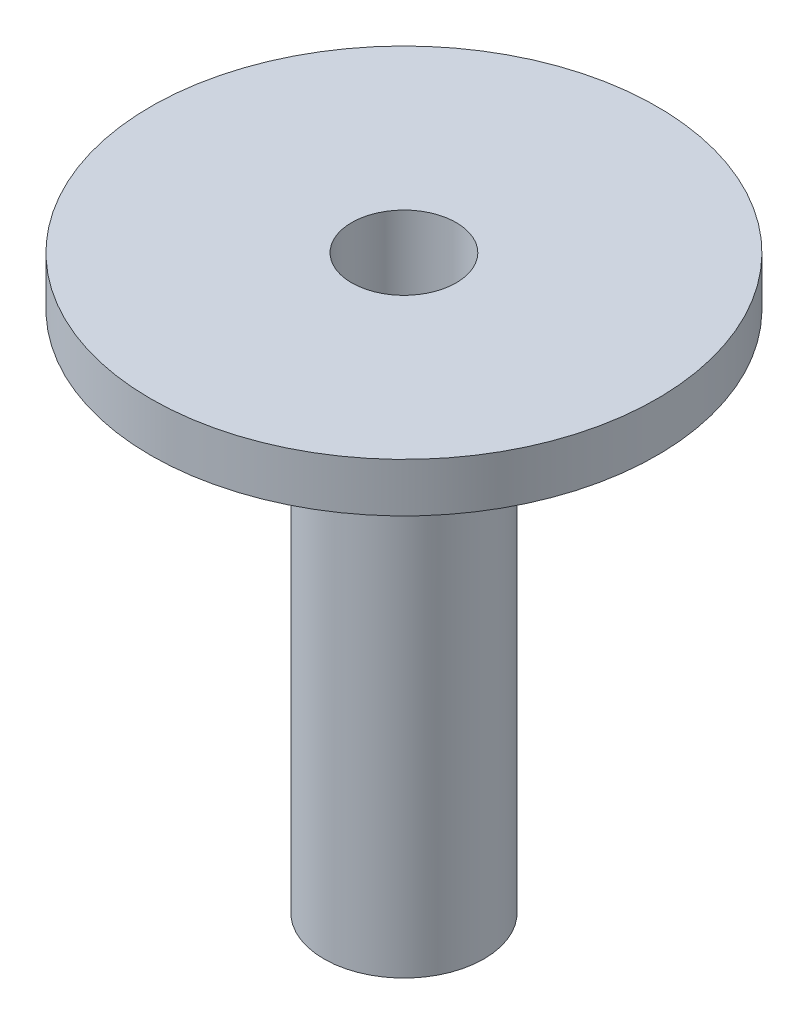
ISO-10303-21;
HEADER;
FILE_DESCRIPTION(('STEP AP214'),'2;1');
FILE_NAME('part.step','',(''),(''),'','','');
FILE_SCHEMA(('AUTOMOTIVE_DESIGN { 1 0 10303 214 1 1 1 1 }'));
ENDSEC;
DATA;
#1=APPLICATION_CONTEXT('core data for automotive mechanical design processes');
#2=APPLICATION_PROTOCOL_DEFINITION('international standard','automotive_design',2000,#1);
#3=PRODUCT_CONTEXT('',#1,'mechanical');
#4=PRODUCT('Part','Part','',(#3));
#5=PRODUCT_RELATED_PRODUCT_CATEGORY('part','',(#4));
#6=PRODUCT_DEFINITION_FORMATION('','',#4);
#7=PRODUCT_DEFINITION_CONTEXT('part definition',#1,'design');
#8=PRODUCT_DEFINITION('design','',#6,#7);
#9=PRODUCT_DEFINITION_SHAPE('','',#8);
#10=(LENGTH_UNIT() NAMED_UNIT(*) SI_UNIT(.MILLI.,.METRE.));
#11=(NAMED_UNIT(*) PLANE_ANGLE_UNIT() SI_UNIT($,.RADIAN.));
#12=(NAMED_UNIT(*) SI_UNIT($,.STERADIAN.) SOLID_ANGLE_UNIT());
#13=UNCERTAINTY_MEASURE_WITH_UNIT(LENGTH_MEASURE(1.E-05),#10,'distance_accuracy_value','');
#14=(GEOMETRIC_REPRESENTATION_CONTEXT(3) GLOBAL_UNCERTAINTY_ASSIGNED_CONTEXT((#13)) GLOBAL_UNIT_ASSIGNED_CONTEXT((#10,
#11,#12)) REPRESENTATION_CONTEXT('',''));
#15=CARTESIAN_POINT('',(0.,0.,0.));
#16=DIRECTION('',(0.,0.,1.));
#17=DIRECTION('',(1.,0.,0.));
#18=AXIS2_PLACEMENT_3D('',#15,#16,#17);
#19=CARTESIAN_POINT('',(0.,0.,0.));
#20=DIRECTION('',(0.,1.,0.));
#21=DIRECTION('',(0.,0.,1.));
#22=AXIS2_PLACEMENT_3D('',#19,#20,#21);
#23=PLANE('',#22);
#24=CARTESIAN_POINT('',(0.,0.,0.));
#25=DIRECTION('',(0.,1.,0.));
#26=DIRECTION('',(0.,0.,1.));
#27=AXIS2_PLACEMENT_3D('',#24,#25,#26);
#28=CIRCLE('',#27,7.75);
#29=CARTESIAN_POINT('',(0.,0.,7.75));
#30=VERTEX_POINT('',#29);
#31=EDGE_CURVE('E70',#30,#30,#28,.T.);
#32=ORIENTED_EDGE('',*,*,#31,.F.);
#33=EDGE_LOOP('',(#32));
#34=FACE_BOUND('',#33,.T.);
#35=CARTESIAN_POINT('',(0.,0.,0.));
#36=DIRECTION('',(0.,1.,0.));
#37=DIRECTION('',(0.,0.,1.));
#38=AXIS2_PLACEMENT_3D('',#35,#36,#37);
#39=CIRCLE('',#38,2.45);
#40=CARTESIAN_POINT('',(0.,0.,2.45));
#41=VERTEX_POINT('',#40);
#42=EDGE_CURVE('E11',#41,#41,#39,.F.);
#43=ORIENTED_EDGE('',*,*,#42,.F.);
#44=EDGE_LOOP('',(#43));
#45=FACE_BOUND('',#44,.T.);
#46=ADVANCED_FACE('F57',(#34,#45),#23,.F.);
#47=CARTESIAN_POINT('',(0.,1.5,0.));
#48=DIRECTION('',(0.,-1.,0.));
#49=DIRECTION('',(0.,0.,-1.));
#50=AXIS2_PLACEMENT_3D('',#47,#48,#49);
#51=CYLINDRICAL_SURFACE('',#50,7.75);
#52=CARTESIAN_POINT('',(0.,1.5,0.));
#53=DIRECTION('',(0.,1.,0.));
#54=DIRECTION('',(0.,0.,1.));
#55=AXIS2_PLACEMENT_3D('',#52,#53,#54);
#56=CIRCLE('',#55,7.75);
#57=CARTESIAN_POINT('',(0.,1.5,7.75));
#58=VERTEX_POINT('',#57);
#59=EDGE_CURVE('E65',#58,#58,#56,.T.);
#60=ORIENTED_EDGE('',*,*,#59,.F.);
#61=EDGE_LOOP('',(#60));
#62=FACE_BOUND('',#61,.T.);
#63=ORIENTED_EDGE('',*,*,#31,.T.);
#64=EDGE_LOOP('',(#63));
#65=FACE_BOUND('',#64,.T.);
#66=ADVANCED_FACE('F59',(#62,#65),#51,.T.);
#67=CARTESIAN_POINT('',(0.,1.5,0.));
#68=DIRECTION('',(0.,1.,0.));
#69=DIRECTION('',(0.,0.,1.));
#70=AXIS2_PLACEMENT_3D('',#67,#68,#69);
#71=PLANE('',#70);
#72=CARTESIAN_POINT('',(0.,1.5,0.));
#73=DIRECTION('',(0.,1.,0.));
#74=DIRECTION('',(0.,0.,1.));
#75=AXIS2_PLACEMENT_3D('',#72,#73,#74);
#76=CIRCLE('',#75,1.6);
#77=CARTESIAN_POINT('',(0.,1.5,1.6));
#78=VERTEX_POINT('',#77);
#79=EDGE_CURVE('E76',#78,#78,#76,.T.);
#80=ORIENTED_EDGE('',*,*,#79,.F.);
#81=EDGE_LOOP('',(#80));
#82=FACE_BOUND('',#81,.T.);
#83=ORIENTED_EDGE('',*,*,#59,.T.);
#84=EDGE_LOOP('',(#83));
#85=FACE_BOUND('',#84,.T.);
#86=ADVANCED_FACE('F103',(#82,#85),#71,.T.);
#87=CARTESIAN_POINT('',(0.,0.,0.));
#88=DIRECTION('',(0.,1.,0.));
#89=DIRECTION('',(0.,0.,1.));
#90=AXIS2_PLACEMENT_3D('',#87,#88,#89);
#91=CYLINDRICAL_SURFACE('',#90,1.6);
#92=ORIENTED_EDGE('',*,*,#79,.T.);
#93=EDGE_LOOP('',(#92));
#94=FACE_BOUND('',#93,.T.);
#95=CARTESIAN_POINT('',(0.,-16.,0.));
#96=DIRECTION('',(0.,-1.,0.));
#97=DIRECTION('',(0.,0.,-1.));
#98=AXIS2_PLACEMENT_3D('',#95,#96,#97);
#99=CIRCLE('',#98,1.6);
#100=CARTESIAN_POINT('',(0.,-16.,-1.6));
#101=VERTEX_POINT('',#100);
#102=EDGE_CURVE('E85',#101,#101,#99,.T.);
#103=ORIENTED_EDGE('',*,*,#102,.T.);
#104=EDGE_LOOP('',(#103));
#105=FACE_BOUND('',#104,.T.);
#106=ADVANCED_FACE('F90',(#94,#105),#91,.F.);
#107=CARTESIAN_POINT('',(0.,-16.,0.));
#108=DIRECTION('',(0.,-1.,0.));
#109=DIRECTION('',(0.,0.,-1.));
#110=AXIS2_PLACEMENT_3D('',#107,#108,#109);
#111=PLANE('',#110);
#112=CARTESIAN_POINT('',(0.,-16.,0.));
#113=DIRECTION('',(0.,-1.,0.));
#114=DIRECTION('',(0.,0.,-1.));
#115=AXIS2_PLACEMENT_3D('',#112,#113,#114);
#116=CIRCLE('',#115,2.45);
#117=CARTESIAN_POINT('',(0.,-16.,-2.45));
#118=VERTEX_POINT('',#117);
#119=EDGE_CURVE('E81',#118,#118,#116,.T.);
#120=ORIENTED_EDGE('',*,*,#119,.T.);
#121=EDGE_LOOP('',(#120));
#122=FACE_BOUND('',#121,.T.);
#123=ORIENTED_EDGE('',*,*,#102,.F.);
#124=EDGE_LOOP('',(#123));
#125=FACE_BOUND('',#124,.T.);
#126=ADVANCED_FACE('F92',(#122,#125),#111,.T.);
#127=CARTESIAN_POINT('',(0.,-16.,0.));
#128=DIRECTION('',(0.,1.,0.));
#129=DIRECTION('',(0.,0.,1.));
#130=AXIS2_PLACEMENT_3D('',#127,#128,#129);
#131=CYLINDRICAL_SURFACE('',#130,2.45);
#132=ORIENTED_EDGE('',*,*,#119,.F.);
#133=EDGE_LOOP('',(#132));
#134=FACE_BOUND('',#133,.T.);
#135=ORIENTED_EDGE('',*,*,#42,.T.);
#136=EDGE_LOOP('',(#135));
#137=FACE_BOUND('',#136,.T.);
#138=ADVANCED_FACE('F94',(#134,#137),#131,.T.);
#139=CLOSED_SHELL('',(#46,#66,#86,#106,#126,#138));
#140=MANIFOLD_SOLID_BREP('B2',#139);
#141=ADVANCED_BREP_SHAPE_REPRESENTATION('',(#18,#140),#14);
#142=SHAPE_DEFINITION_REPRESENTATION(#9,#141);
ENDSEC;
END-ISO-10303-21;
